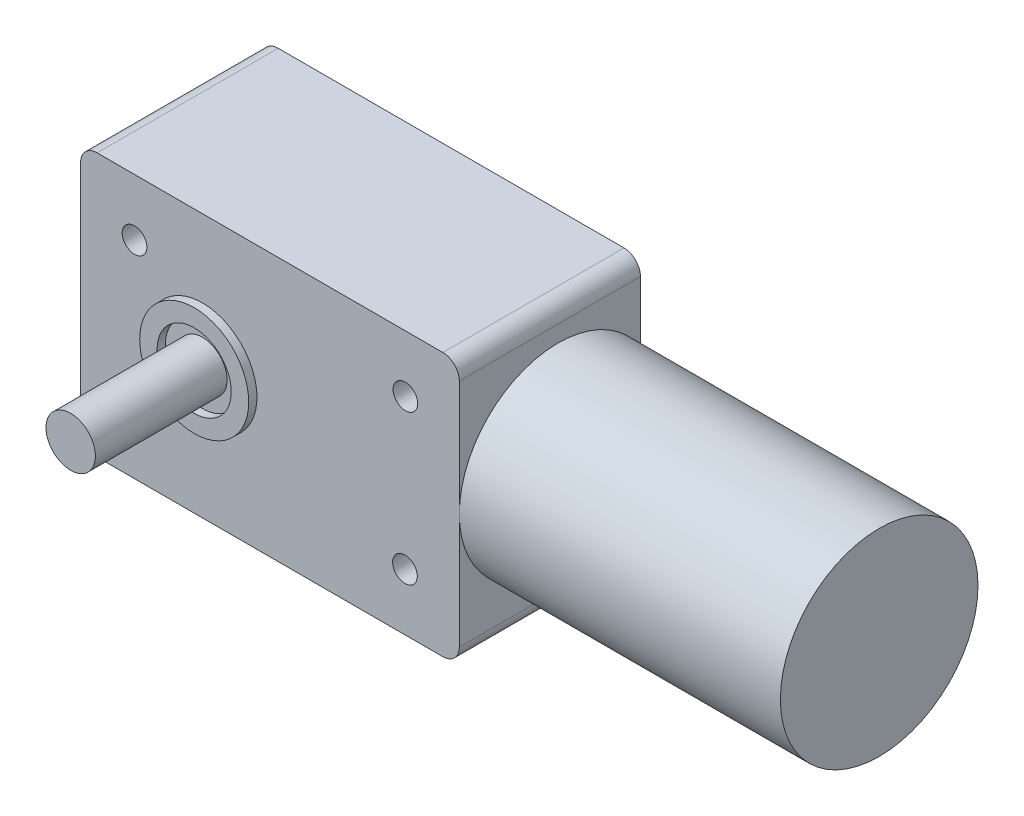
ISO-10303-21;
HEADER;
FILE_DESCRIPTION(('STEP AP214'),'2;1');
FILE_NAME('part.step','',(''),(''),'','','');
FILE_SCHEMA(('AUTOMOTIVE_DESIGN { 1 0 10303 214 1 1 1 1 }'));
ENDSEC;
DATA;
#1=APPLICATION_CONTEXT('core data for automotive mechanical design processes');
#2=APPLICATION_PROTOCOL_DEFINITION('international standard','automotive_design',2000,#1);
#3=PRODUCT_CONTEXT('',#1,'mechanical');
#4=PRODUCT('Part','Part','',(#3));
#5=PRODUCT_RELATED_PRODUCT_CATEGORY('part','',(#4));
#6=PRODUCT_DEFINITION_FORMATION('','',#4);
#7=PRODUCT_DEFINITION_CONTEXT('part definition',#1,'design');
#8=PRODUCT_DEFINITION('design','',#6,#7);
#9=PRODUCT_DEFINITION_SHAPE('','',#8);
#10=(LENGTH_UNIT() NAMED_UNIT(*) SI_UNIT(.MILLI.,.METRE.));
#11=(NAMED_UNIT(*) PLANE_ANGLE_UNIT() SI_UNIT($,.RADIAN.));
#12=(NAMED_UNIT(*) SI_UNIT($,.STERADIAN.) SOLID_ANGLE_UNIT());
#13=UNCERTAINTY_MEASURE_WITH_UNIT(LENGTH_MEASURE(1.E-05),#10,'distance_accuracy_value','');
#14=(GEOMETRIC_REPRESENTATION_CONTEXT(3) GLOBAL_UNCERTAINTY_ASSIGNED_CONTEXT((#13)) GLOBAL_UNIT_ASSIGNED_CONTEXT((#10,
#11,#12)) REPRESENTATION_CONTEXT('',''));
#15=CARTESIAN_POINT('',(0.,0.,0.));
#16=DIRECTION('',(0.,0.,1.));
#17=DIRECTION('',(1.,0.,0.));
#18=AXIS2_PLACEMENT_3D('',#15,#16,#17);
#19=CARTESIAN_POINT('',(23.,-14.,22.));
#20=DIRECTION('',(-1.,0.,0.));
#21=DIRECTION('',(0.,0.,1.));
#22=AXIS2_PLACEMENT_3D('',#19,#20,#21);
#23=PLANE('',#22);
#24=CARTESIAN_POINT('',(23.,0.,10.));
#25=DIRECTION('',(1.,0.,0.));
#26=DIRECTION('',(0.,0.,-1.));
#27=AXIS2_PLACEMENT_3D('',#24,#25,#26);
#28=CIRCLE('',#27,12.);
#29=CARTESIAN_POINT('',(23.,0.,22.));
#30=VERTEX_POINT('',#29);
#31=CARTESIAN_POINT('',(23.,-6.63324958071081,0.));
#32=VERTEX_POINT('',#31);
#33=EDGE_CURVE('E50',#30,#32,#28,.T.);
#34=ORIENTED_EDGE('',*,*,#33,.F.);
#35=DIRECTION('',(0.,1.,0.));
#36=VECTOR('',#35,1.);
#37=CARTESIAN_POINT('',(23.,-14.,22.));
#38=LINE('',#37,#36);
#39=CARTESIAN_POINT('',(23.,-14.,22.));
#40=VERTEX_POINT('',#39);
#41=EDGE_CURVE('E182',#40,#30,#38,.T.);
#42=ORIENTED_EDGE('',*,*,#41,.F.);
#43=DIRECTION('',(0.,0.,-1.));
#44=VECTOR('',#43,1.);
#45=CARTESIAN_POINT('',(23.,-14.,22.));
#46=LINE('',#45,#44);
#47=CARTESIAN_POINT('',(23.,-14.,0.));
#48=VERTEX_POINT('',#47);
#49=EDGE_CURVE('E217',#40,#48,#46,.T.);
#50=ORIENTED_EDGE('',*,*,#49,.T.);
#51=DIRECTION('',(0.,1.,0.));
#52=VECTOR('',#51,1.);
#53=CARTESIAN_POINT('',(23.,-14.,0.));
#54=LINE('',#53,#52);
#55=EDGE_CURVE('E120',#48,#32,#54,.T.);
#56=ORIENTED_EDGE('',*,*,#55,.T.);
#57=EDGE_LOOP('',(#34,#42,#50,#56));
#58=FACE_BOUND('',#57,.T.);
#59=ADVANCED_FACE('F35',(#58),#23,.F.);
#60=CARTESIAN_POINT('',(-21.,-14.,22.));
#61=DIRECTION('',(0.,0.,-1.));
#62=DIRECTION('',(-1.,0.,0.));
#63=AXIS2_PLACEMENT_3D('',#60,#61,#62);
#64=CYLINDRICAL_SURFACE('',#63,2.);
#65=CARTESIAN_POINT('',(-21.,-14.,0.));
#66=DIRECTION('',(0.,0.,1.));
#67=DIRECTION('',(-1.,0.,0.));
#68=AXIS2_PLACEMENT_3D('',#65,#66,#67);
#69=CIRCLE('',#68,2.);
#70=CARTESIAN_POINT('',(-23.,-14.,0.));
#71=VERTEX_POINT('',#70);
#72=CARTESIAN_POINT('',(-21.,-16.,0.));
#73=VERTEX_POINT('',#72);
#74=EDGE_CURVE('E171',#71,#73,#69,.T.);
#75=ORIENTED_EDGE('',*,*,#74,.T.);
#76=DIRECTION('',(0.,0.,-1.));
#77=VECTOR('',#76,1.);
#78=CARTESIAN_POINT('',(-21.,-16.,22.));
#79=LINE('',#78,#77);
#80=CARTESIAN_POINT('',(-21.,-16.,22.));
#81=VERTEX_POINT('',#80);
#82=EDGE_CURVE('E223',#81,#73,#79,.T.);
#83=ORIENTED_EDGE('',*,*,#82,.F.);
#84=CARTESIAN_POINT('',(-21.,-14.,22.));
#85=DIRECTION('',(0.,0.,1.));
#86=DIRECTION('',(-1.,0.,0.));
#87=AXIS2_PLACEMENT_3D('',#84,#85,#86);
#88=CIRCLE('',#87,2.);
#89=CARTESIAN_POINT('',(-23.,-14.,22.));
#90=VERTEX_POINT('',#89);
#91=EDGE_CURVE('E174',#90,#81,#88,.T.);
#92=ORIENTED_EDGE('',*,*,#91,.F.);
#93=DIRECTION('',(0.,0.,-1.));
#94=VECTOR('',#93,1.);
#95=CARTESIAN_POINT('',(-23.,-14.,22.));
#96=LINE('',#95,#94);
#97=EDGE_CURVE('E192',#90,#71,#96,.T.);
#98=ORIENTED_EDGE('',*,*,#97,.T.);
#99=EDGE_LOOP('',(#75,#83,#92,#98));
#100=FACE_BOUND('',#99,.T.);
#101=ADVANCED_FACE('F37',(#100),#64,.T.);
#102=CARTESIAN_POINT('',(-21.,-16.,22.));
#103=DIRECTION('',(0.,1.,0.));
#104=DIRECTION('',(0.,0.,1.));
#105=AXIS2_PLACEMENT_3D('',#102,#103,#104);
#106=PLANE('',#105);
#107=DIRECTION('',(1.,0.,0.));
#108=VECTOR('',#107,1.);
#109=CARTESIAN_POINT('',(-21.,-16.,0.));
#110=LINE('',#109,#108);
#111=CARTESIAN_POINT('',(21.,-16.,0.));
#112=VERTEX_POINT('',#111);
#113=EDGE_CURVE('E195',#73,#112,#110,.T.);
#114=ORIENTED_EDGE('',*,*,#113,.T.);
#115=DIRECTION('',(0.,0.,-1.));
#116=VECTOR('',#115,1.);
#117=CARTESIAN_POINT('',(21.,-16.,22.));
#118=LINE('',#117,#116);
#119=CARTESIAN_POINT('',(21.,-16.,22.));
#120=VERTEX_POINT('',#119);
#121=EDGE_CURVE('E220',#120,#112,#118,.T.);
#122=ORIENTED_EDGE('',*,*,#121,.F.);
#123=DIRECTION('',(1.,0.,0.));
#124=VECTOR('',#123,1.);
#125=CARTESIAN_POINT('',(-21.,-16.,22.));
#126=LINE('',#125,#124);
#127=EDGE_CURVE('E177',#81,#120,#126,.T.);
#128=ORIENTED_EDGE('',*,*,#127,.F.);
#129=ORIENTED_EDGE('',*,*,#82,.T.);
#130=EDGE_LOOP('',(#114,#122,#128,#129));
#131=FACE_BOUND('',#130,.T.);
#132=ADVANCED_FACE('F251',(#131),#106,.F.);
#133=CARTESIAN_POINT('',(21.,-14.,22.));
#134=DIRECTION('',(0.,0.,-1.));
#135=DIRECTION('',(-1.,0.,0.));
#136=AXIS2_PLACEMENT_3D('',#133,#134,#135);
#137=CYLINDRICAL_SURFACE('',#136,2.);
#138=CARTESIAN_POINT('',(21.,-14.,0.));
#139=DIRECTION('',(0.,0.,1.));
#140=DIRECTION('',(1.,0.,0.));
#141=AXIS2_PLACEMENT_3D('',#138,#139,#140);
#142=CIRCLE('',#141,2.);
#143=EDGE_CURVE('E118',#112,#48,#142,.T.);
#144=ORIENTED_EDGE('',*,*,#143,.T.);
#145=ORIENTED_EDGE('',*,*,#49,.F.);
#146=CARTESIAN_POINT('',(21.,-14.,22.));
#147=DIRECTION('',(0.,0.,1.));
#148=DIRECTION('',(1.,0.,0.));
#149=AXIS2_PLACEMENT_3D('',#146,#147,#148);
#150=CIRCLE('',#149,2.);
#151=EDGE_CURVE('E180',#120,#40,#150,.T.);
#152=ORIENTED_EDGE('',*,*,#151,.F.);
#153=ORIENTED_EDGE('',*,*,#121,.T.);
#154=EDGE_LOOP('',(#144,#145,#152,#153));
#155=FACE_BOUND('',#154,.T.);
#156=ADVANCED_FACE('F256',(#155),#137,.T.);
#157=CARTESIAN_POINT('',(23.,6.63324958071081,0.));
#158=VERTEX_POINT('',#157);
#159=EDGE_CURVE('E122',#158,#30,#28,.T.);
#160=ORIENTED_EDGE('',*,*,#159,.F.);
#161=CARTESIAN_POINT('',(23.,14.,0.));
#162=VERTEX_POINT('',#161);
#163=EDGE_CURVE('E109',#158,#162,#54,.T.);
#164=ORIENTED_EDGE('',*,*,#163,.T.);
#165=DIRECTION('',(0.,0.,-1.));
#166=VECTOR('',#165,1.);
#167=CARTESIAN_POINT('',(23.,14.,22.));
#168=LINE('',#167,#166);
#169=CARTESIAN_POINT('',(23.,14.,22.));
#170=VERTEX_POINT('',#169);
#171=EDGE_CURVE('E215',#170,#162,#168,.T.);
#172=ORIENTED_EDGE('',*,*,#171,.F.);
#173=EDGE_CURVE('E124',#30,#170,#38,.T.);
#174=ORIENTED_EDGE('',*,*,#173,.F.);
#175=EDGE_LOOP('',(#160,#164,#172,#174));
#176=FACE_BOUND('',#175,.T.);
#177=ADVANCED_FACE('F123',(#176),#23,.F.);
#178=CARTESIAN_POINT('',(21.,14.,22.));
#179=DIRECTION('',(0.,0.,-1.));
#180=DIRECTION('',(-1.,0.,0.));
#181=AXIS2_PLACEMENT_3D('',#178,#179,#180);
#182=CYLINDRICAL_SURFACE('',#181,2.);
#183=CARTESIAN_POINT('',(21.,14.,0.));
#184=DIRECTION('',(0.,0.,1.));
#185=DIRECTION('',(-1.,0.,0.));
#186=AXIS2_PLACEMENT_3D('',#183,#184,#185);
#187=CIRCLE('',#186,2.);
#188=CARTESIAN_POINT('',(21.,16.,0.));
#189=VERTEX_POINT('',#188);
#190=EDGE_CURVE('E114',#162,#189,#187,.T.);
#191=ORIENTED_EDGE('',*,*,#190,.T.);
#192=DIRECTION('',(0.,0.,-1.));
#193=VECTOR('',#192,1.);
#194=CARTESIAN_POINT('',(21.,16.,22.));
#195=LINE('',#194,#193);
#196=CARTESIAN_POINT('',(21.,16.,22.));
#197=VERTEX_POINT('',#196);
#198=EDGE_CURVE('E212',#197,#189,#195,.T.);
#199=ORIENTED_EDGE('',*,*,#198,.F.);
#200=CARTESIAN_POINT('',(21.,14.,22.));
#201=DIRECTION('',(0.,0.,1.));
#202=DIRECTION('',(-1.,0.,0.));
#203=AXIS2_PLACEMENT_3D('',#200,#201,#202);
#204=CIRCLE('',#203,2.);
#205=EDGE_CURVE('E184',#170,#197,#204,.T.);
#206=ORIENTED_EDGE('',*,*,#205,.F.);
#207=ORIENTED_EDGE('',*,*,#171,.T.);
#208=EDGE_LOOP('',(#191,#199,#206,#207));
#209=FACE_BOUND('',#208,.T.);
#210=ADVANCED_FACE('F271',(#209),#182,.T.);
#211=CARTESIAN_POINT('',(-21.,16.,22.));
#212=DIRECTION('',(0.,-1.,0.));
#213=DIRECTION('',(0.,0.,-1.));
#214=AXIS2_PLACEMENT_3D('',#211,#212,#213);
#215=PLANE('',#214);
#216=DIRECTION('',(-1.,0.,0.));
#217=VECTOR('',#216,1.);
#218=CARTESIAN_POINT('',(-21.,16.,0.));
#219=LINE('',#218,#217);
#220=CARTESIAN_POINT('',(-21.,16.,0.));
#221=VERTEX_POINT('',#220);
#222=EDGE_CURVE('E199',#189,#221,#219,.T.);
#223=ORIENTED_EDGE('',*,*,#222,.T.);
#224=DIRECTION('',(0.,0.,-1.));
#225=VECTOR('',#224,1.);
#226=CARTESIAN_POINT('',(-21.,16.,22.));
#227=LINE('',#226,#225);
#228=CARTESIAN_POINT('',(-21.,16.,22.));
#229=VERTEX_POINT('',#228);
#230=EDGE_CURVE('E209',#229,#221,#227,.T.);
#231=ORIENTED_EDGE('',*,*,#230,.F.);
#232=DIRECTION('',(-1.,0.,0.));
#233=VECTOR('',#232,1.);
#234=CARTESIAN_POINT('',(-21.,16.,22.));
#235=LINE('',#234,#233);
#236=EDGE_CURVE('E186',#197,#229,#235,.T.);
#237=ORIENTED_EDGE('',*,*,#236,.F.);
#238=ORIENTED_EDGE('',*,*,#198,.T.);
#239=EDGE_LOOP('',(#223,#231,#237,#238));
#240=FACE_BOUND('',#239,.T.);
#241=ADVANCED_FACE('F267',(#240),#215,.F.);
#242=CARTESIAN_POINT('',(-21.,14.,22.));
#243=DIRECTION('',(0.,0.,-1.));
#244=DIRECTION('',(-1.,0.,0.));
#245=AXIS2_PLACEMENT_3D('',#242,#243,#244);
#246=CYLINDRICAL_SURFACE('',#245,2.);
#247=CARTESIAN_POINT('',(-21.,14.,0.));
#248=DIRECTION('',(0.,0.,1.));
#249=DIRECTION('',(-1.,0.,0.));
#250=AXIS2_PLACEMENT_3D('',#247,#248,#249);
#251=CIRCLE('',#250,2.);
#252=CARTESIAN_POINT('',(-23.,14.,0.));
#253=VERTEX_POINT('',#252);
#254=EDGE_CURVE('E201',#221,#253,#251,.T.);
#255=ORIENTED_EDGE('',*,*,#254,.T.);
#256=DIRECTION('',(0.,0.,-1.));
#257=VECTOR('',#256,1.);
#258=CARTESIAN_POINT('',(-23.,14.,22.));
#259=LINE('',#258,#257);
#260=CARTESIAN_POINT('',(-23.,14.,22.));
#261=VERTEX_POINT('',#260);
#262=EDGE_CURVE('E206',#261,#253,#259,.T.);
#263=ORIENTED_EDGE('',*,*,#262,.F.);
#264=CARTESIAN_POINT('',(-21.,14.,22.));
#265=DIRECTION('',(0.,0.,1.));
#266=DIRECTION('',(-1.,0.,0.));
#267=AXIS2_PLACEMENT_3D('',#264,#265,#266);
#268=CIRCLE('',#267,2.);
#269=EDGE_CURVE('E188',#229,#261,#268,.T.);
#270=ORIENTED_EDGE('',*,*,#269,.F.);
#271=ORIENTED_EDGE('',*,*,#230,.T.);
#272=EDGE_LOOP('',(#255,#263,#270,#271));
#273=FACE_BOUND('',#272,.T.);
#274=ADVANCED_FACE('F263',(#273),#246,.T.);
#275=CARTESIAN_POINT('',(-23.,-14.,22.));
#276=DIRECTION('',(1.,0.,0.));
#277=DIRECTION('',(0.,0.,-1.));
#278=AXIS2_PLACEMENT_3D('',#275,#276,#277);
#279=PLANE('',#278);
#280=DIRECTION('',(0.,-1.,0.));
#281=VECTOR('',#280,1.);
#282=CARTESIAN_POINT('',(-23.,-14.,0.));
#283=LINE('',#282,#281);
#284=EDGE_CURVE('E178',#253,#71,#283,.T.);
#285=ORIENTED_EDGE('',*,*,#284,.T.);
#286=ORIENTED_EDGE('',*,*,#97,.F.);
#287=DIRECTION('',(0.,-1.,0.));
#288=VECTOR('',#287,1.);
#289=CARTESIAN_POINT('',(-23.,-14.,22.));
#290=LINE('',#289,#288);
#291=EDGE_CURVE('E190',#261,#90,#290,.T.);
#292=ORIENTED_EDGE('',*,*,#291,.F.);
#293=ORIENTED_EDGE('',*,*,#262,.T.);
#294=EDGE_LOOP('',(#285,#286,#292,#293));
#295=FACE_BOUND('',#294,.T.);
#296=ADVANCED_FACE('F233',(#295),#279,.F.);
#297=CARTESIAN_POINT('',(-21.,-14.,22.));
#298=DIRECTION('',(0.,0.,-1.));
#299=DIRECTION('',(-1.,0.,0.));
#300=AXIS2_PLACEMENT_3D('',#297,#298,#299);
#301=PLANE('',#300);
#302=CARTESIAN_POINT('',(-8.19999999999999,0.,22.));
#303=DIRECTION('',(0.,0.,-1.));
#304=DIRECTION('',(-1.,0.,0.));
#305=AXIS2_PLACEMENT_3D('',#302,#303,#304);
#306=CIRCLE('',#305,6.62);
#307=CARTESIAN_POINT('',(-14.82,0.,22.));
#308=VERTEX_POINT('',#307);
#309=EDGE_CURVE('E43',#308,#308,#306,.F.);
#310=ORIENTED_EDGE('',*,*,#309,.F.);
#311=EDGE_LOOP('',(#310));
#312=FACE_BOUND('',#311,.T.);
#313=CARTESIAN_POINT('',(-16.4999999999998,-9.09993131855173,22.));
#314=DIRECTION('',(0.,0.,1.));
#315=DIRECTION('',(1.,0.,0.));
#316=AXIS2_PLACEMENT_3D('',#313,#314,#315);
#317=CIRCLE('',#316,1.49999999999999);
#318=CARTESIAN_POINT('',(-14.9999999999998,-9.09993131855173,22.));
#319=VERTEX_POINT('',#318);
#320=EDGE_CURVE('E147',#319,#319,#317,.T.);
#321=ORIENTED_EDGE('',*,*,#320,.F.);
#322=EDGE_LOOP('',(#321));
#323=FACE_BOUND('',#322,.T.);
#324=CARTESIAN_POINT('',(16.4000000000002,-9.09993131855172,22.));
#325=DIRECTION('',(0.,0.,1.));
#326=DIRECTION('',(1.,0.,0.));
#327=AXIS2_PLACEMENT_3D('',#324,#325,#326);
#328=CIRCLE('',#327,1.5);
#329=CARTESIAN_POINT('',(17.9000000000002,-9.09993131855172,22.));
#330=VERTEX_POINT('',#329);
#331=EDGE_CURVE('E160',#330,#330,#328,.T.);
#332=ORIENTED_EDGE('',*,*,#331,.F.);
#333=EDGE_LOOP('',(#332));
#334=FACE_BOUND('',#333,.T.);
#335=CARTESIAN_POINT('',(16.45,9.1,22.));
#336=DIRECTION('',(0.,0.,1.));
#337=DIRECTION('',(1.,0.,0.));
#338=AXIS2_PLACEMENT_3D('',#335,#336,#337);
#339=CIRCLE('',#338,1.5);
#340=CARTESIAN_POINT('',(17.95,9.1,22.));
#341=VERTEX_POINT('',#340);
#342=EDGE_CURVE('E154',#341,#341,#339,.T.);
#343=ORIENTED_EDGE('',*,*,#342,.F.);
#344=EDGE_LOOP('',(#343));
#345=FACE_BOUND('',#344,.T.);
#346=CARTESIAN_POINT('',(-16.45,9.1,22.));
#347=DIRECTION('',(0.,0.,1.));
#348=DIRECTION('',(1.,0.,0.));
#349=AXIS2_PLACEMENT_3D('',#346,#347,#348);
#350=CIRCLE('',#349,1.5);
#351=CARTESIAN_POINT('',(-14.95,9.1,22.));
#352=VERTEX_POINT('',#351);
#353=EDGE_CURVE('E153',#352,#352,#350,.T.);
#354=ORIENTED_EDGE('',*,*,#353,.F.);
#355=EDGE_LOOP('',(#354));
#356=FACE_BOUND('',#355,.T.);
#357=ORIENTED_EDGE('',*,*,#91,.T.);
#358=ORIENTED_EDGE('',*,*,#127,.T.);
#359=ORIENTED_EDGE('',*,*,#151,.T.);
#360=ORIENTED_EDGE('',*,*,#41,.T.);
#361=ORIENTED_EDGE('',*,*,#173,.T.);
#362=ORIENTED_EDGE('',*,*,#205,.T.);
#363=ORIENTED_EDGE('',*,*,#236,.T.);
#364=ORIENTED_EDGE('',*,*,#269,.T.);
#365=ORIENTED_EDGE('',*,*,#291,.T.);
#366=EDGE_LOOP('',(#357,#358,#359,#360,#361,#362,#363,#364,#365));
#367=FACE_BOUND('',#366,.T.);
#368=ADVANCED_FACE('F230',(#312,#323,#334,#345,#356,#367),#301,.F.);
#369=CARTESIAN_POINT('',(-21.,-14.,0.));
#370=DIRECTION('',(0.,0.,-1.));
#371=DIRECTION('',(-1.,0.,0.));
#372=AXIS2_PLACEMENT_3D('',#369,#370,#371);
#373=PLANE('',#372);
#374=ORIENTED_EDGE('',*,*,#74,.F.);
#375=ORIENTED_EDGE('',*,*,#284,.F.);
#376=ORIENTED_EDGE('',*,*,#254,.F.);
#377=ORIENTED_EDGE('',*,*,#222,.F.);
#378=ORIENTED_EDGE('',*,*,#190,.F.);
#379=ORIENTED_EDGE('',*,*,#163,.F.);
#380=EDGE_CURVE('E58',#32,#158,#54,.T.);
#381=ORIENTED_EDGE('',*,*,#380,.F.);
#382=ORIENTED_EDGE('',*,*,#55,.F.);
#383=ORIENTED_EDGE('',*,*,#143,.F.);
#384=ORIENTED_EDGE('',*,*,#113,.F.);
#385=EDGE_LOOP('',(#374,#375,#376,#377,#378,#379,#381,#382,#383,#384));
#386=FACE_BOUND('',#385,.T.);
#387=ADVANCED_FACE('F112',(#386),#373,.T.);
#388=CARTESIAN_POINT('',(-16.45,9.1,19.));
#389=DIRECTION('',(0.,0.,1.));
#390=DIRECTION('',(1.,0.,0.));
#391=AXIS2_PLACEMENT_3D('',#388,#389,#390);
#392=CYLINDRICAL_SURFACE('',#391,1.5);
#393=CARTESIAN_POINT('',(-16.45,9.1,19.));
#394=DIRECTION('',(0.,0.,1.));
#395=DIRECTION('',(1.,0.,0.));
#396=AXIS2_PLACEMENT_3D('',#393,#394,#395);
#397=CIRCLE('',#396,1.5);
#398=CARTESIAN_POINT('',(-14.95,9.1,19.));
#399=VERTEX_POINT('',#398);
#400=EDGE_CURVE('E168',#399,#399,#397,.T.);
#401=ORIENTED_EDGE('',*,*,#400,.F.);
#402=EDGE_LOOP('',(#401));
#403=FACE_BOUND('',#402,.T.);
#404=ORIENTED_EDGE('',*,*,#353,.T.);
#405=EDGE_LOOP('',(#404));
#406=FACE_BOUND('',#405,.T.);
#407=ADVANCED_FACE('F320',(#403,#406),#392,.F.);
#408=CARTESIAN_POINT('',(-16.45,9.1,19.));
#409=DIRECTION('',(0.,0.,1.));
#410=DIRECTION('',(1.,0.,0.));
#411=AXIS2_PLACEMENT_3D('',#408,#409,#410);
#412=PLANE('',#411);
#413=ORIENTED_EDGE('',*,*,#400,.T.);
#414=EDGE_LOOP('',(#413));
#415=FACE_BOUND('',#414,.T.);
#416=ADVANCED_FACE('F382',(#415),#412,.T.);
#417=CARTESIAN_POINT('',(16.45,9.1,19.));
#418=DIRECTION('',(0.,0.,1.));
#419=DIRECTION('',(1.,0.,0.));
#420=AXIS2_PLACEMENT_3D('',#417,#418,#419);
#421=CYLINDRICAL_SURFACE('',#420,1.5);
#422=CARTESIAN_POINT('',(16.45,9.1,19.));
#423=DIRECTION('',(0.,0.,1.));
#424=DIRECTION('',(1.,0.,0.));
#425=AXIS2_PLACEMENT_3D('',#422,#423,#424);
#426=CIRCLE('',#425,1.5);
#427=CARTESIAN_POINT('',(17.95,9.1,19.));
#428=VERTEX_POINT('',#427);
#429=EDGE_CURVE('E150',#428,#428,#426,.T.);
#430=ORIENTED_EDGE('',*,*,#429,.F.);
#431=EDGE_LOOP('',(#430));
#432=FACE_BOUND('',#431,.T.);
#433=ORIENTED_EDGE('',*,*,#342,.T.);
#434=EDGE_LOOP('',(#433));
#435=FACE_BOUND('',#434,.T.);
#436=ADVANCED_FACE('F378',(#432,#435),#421,.F.);
#437=CARTESIAN_POINT('',(16.45,9.1,19.));
#438=DIRECTION('',(0.,0.,1.));
#439=DIRECTION('',(1.,0.,0.));
#440=AXIS2_PLACEMENT_3D('',#437,#438,#439);
#441=PLANE('',#440);
#442=ORIENTED_EDGE('',*,*,#429,.T.);
#443=EDGE_LOOP('',(#442));
#444=FACE_BOUND('',#443,.T.);
#445=ADVANCED_FACE('F374',(#444),#441,.T.);
#446=CARTESIAN_POINT('',(16.4000000000002,-9.09993131855172,19.));
#447=DIRECTION('',(0.,0.,1.));
#448=DIRECTION('',(1.,0.,0.));
#449=AXIS2_PLACEMENT_3D('',#446,#447,#448);
#450=CYLINDRICAL_SURFACE('',#449,1.5);
#451=CARTESIAN_POINT('',(16.4000000000002,-9.09993131855172,19.));
#452=DIRECTION('',(0.,0.,1.));
#453=DIRECTION('',(1.,0.,0.));
#454=AXIS2_PLACEMENT_3D('',#451,#452,#453);
#455=CIRCLE('',#454,1.5);
#456=CARTESIAN_POINT('',(17.9000000000002,-9.09993131855172,19.));
#457=VERTEX_POINT('',#456);
#458=EDGE_CURVE('E157',#457,#457,#455,.T.);
#459=ORIENTED_EDGE('',*,*,#458,.F.);
#460=EDGE_LOOP('',(#459));
#461=FACE_BOUND('',#460,.T.);
#462=ORIENTED_EDGE('',*,*,#331,.T.);
#463=EDGE_LOOP('',(#462));
#464=FACE_BOUND('',#463,.T.);
#465=ADVANCED_FACE('F377',(#461,#464),#450,.F.);
#466=CARTESIAN_POINT('',(16.4000000000002,-9.09993131855172,19.));
#467=DIRECTION('',(0.,0.,1.));
#468=DIRECTION('',(1.,0.,0.));
#469=AXIS2_PLACEMENT_3D('',#466,#467,#468);
#470=PLANE('',#469);
#471=ORIENTED_EDGE('',*,*,#458,.T.);
#472=EDGE_LOOP('',(#471));
#473=FACE_BOUND('',#472,.T.);
#474=ADVANCED_FACE('F384',(#473),#470,.T.);
#475=CARTESIAN_POINT('',(-16.4999999999998,-9.09993131855173,19.));
#476=DIRECTION('',(0.,0.,1.));
#477=DIRECTION('',(1.,0.,0.));
#478=AXIS2_PLACEMENT_3D('',#475,#476,#477);
#479=CYLINDRICAL_SURFACE('',#478,1.49999999999999);
#480=CARTESIAN_POINT('',(-16.4999999999998,-9.09993131855173,19.));
#481=DIRECTION('',(0.,0.,1.));
#482=DIRECTION('',(1.,0.,0.));
#483=AXIS2_PLACEMENT_3D('',#480,#481,#482);
#484=CIRCLE('',#483,1.49999999999999);
#485=CARTESIAN_POINT('',(-14.9999999999998,-9.09993131855173,19.));
#486=VERTEX_POINT('',#485);
#487=EDGE_CURVE('E163',#486,#486,#484,.T.);
#488=ORIENTED_EDGE('',*,*,#487,.F.);
#489=EDGE_LOOP('',(#488));
#490=FACE_BOUND('',#489,.T.);
#491=ORIENTED_EDGE('',*,*,#320,.T.);
#492=EDGE_LOOP('',(#491));
#493=FACE_BOUND('',#492,.T.);
#494=ADVANCED_FACE('F387',(#490,#493),#479,.F.);
#495=CARTESIAN_POINT('',(-16.4999999999998,-9.09993131855173,19.));
#496=DIRECTION('',(0.,0.,1.));
#497=DIRECTION('',(1.,0.,0.));
#498=AXIS2_PLACEMENT_3D('',#495,#496,#497);
#499=PLANE('',#498);
#500=ORIENTED_EDGE('',*,*,#487,.T.);
#501=EDGE_LOOP('',(#500));
#502=FACE_BOUND('',#501,.T.);
#503=ADVANCED_FACE('F372',(#502),#499,.T.);
#504=CARTESIAN_POINT('',(-8.19999999999999,0.,23.));
#505=DIRECTION('',(0.,0.,-1.));
#506=DIRECTION('',(-1.,0.,0.));
#507=AXIS2_PLACEMENT_3D('',#504,#505,#506);
#508=CYLINDRICAL_SURFACE('',#507,4.5);
#509=CARTESIAN_POINT('',(-8.19999999999999,0.,23.));
#510=DIRECTION('',(0.,0.,1.));
#511=DIRECTION('',(1.,0.,0.));
#512=AXIS2_PLACEMENT_3D('',#509,#510,#511);
#513=CIRCLE('',#512,4.5);
#514=CARTESIAN_POINT('',(-3.69999999999999,0.,23.));
#515=VERTEX_POINT('',#514);
#516=EDGE_CURVE('E141',#515,#515,#513,.T.);
#517=ORIENTED_EDGE('',*,*,#516,.T.);
#518=EDGE_LOOP('',(#517));
#519=FACE_BOUND('',#518,.T.);
#520=CARTESIAN_POINT('',(-8.19999999999999,0.,22.));
#521=DIRECTION('',(0.,0.,1.));
#522=DIRECTION('',(1.,0.,0.));
#523=AXIS2_PLACEMENT_3D('',#520,#521,#522);
#524=CIRCLE('',#523,4.5);
#525=CARTESIAN_POINT('',(-3.69999999999999,0.,22.));
#526=VERTEX_POINT('',#525);
#527=EDGE_CURVE('E140',#526,#526,#524,.T.);
#528=ORIENTED_EDGE('',*,*,#527,.F.);
#529=EDGE_LOOP('',(#528));
#530=FACE_BOUND('',#529,.T.);
#531=ADVANCED_FACE('F368',(#519,#530),#508,.F.);
#532=CARTESIAN_POINT('',(-8.19999999999999,0.,23.));
#533=DIRECTION('',(0.,0.,-1.));
#534=DIRECTION('',(-1.,0.,0.));
#535=AXIS2_PLACEMENT_3D('',#532,#533,#534);
#536=CYLINDRICAL_SURFACE('',#535,6.62);
#537=CARTESIAN_POINT('',(-8.19999999999999,0.,23.));
#538=DIRECTION('',(0.,0.,1.));
#539=DIRECTION('',(1.,0.,0.));
#540=AXIS2_PLACEMENT_3D('',#537,#538,#539);
#541=CIRCLE('',#540,6.62);
#542=CARTESIAN_POINT('',(-1.57999999999999,0.,23.));
#543=VERTEX_POINT('',#542);
#544=EDGE_CURVE('E144',#543,#543,#541,.T.);
#545=ORIENTED_EDGE('',*,*,#544,.F.);
#546=EDGE_LOOP('',(#545));
#547=FACE_BOUND('',#546,.T.);
#548=ORIENTED_EDGE('',*,*,#309,.T.);
#549=EDGE_LOOP('',(#548));
#550=FACE_BOUND('',#549,.T.);
#551=ADVANCED_FACE('F228',(#547,#550),#536,.T.);
#552=CARTESIAN_POINT('',(0.,0.,23.));
#553=DIRECTION('',(0.,0.,1.));
#554=DIRECTION('',(1.,0.,0.));
#555=AXIS2_PLACEMENT_3D('',#552,#553,#554);
#556=PLANE('',#555);
#557=ORIENTED_EDGE('',*,*,#516,.F.);
#558=EDGE_LOOP('',(#557));
#559=FACE_BOUND('',#558,.T.);
#560=ORIENTED_EDGE('',*,*,#544,.T.);
#561=EDGE_LOOP('',(#560));
#562=FACE_BOUND('',#561,.T.);
#563=ADVANCED_FACE('F362',(#559,#562),#556,.T.);
#564=CARTESIAN_POINT('',(-8.19999999999999,0.,22.));
#565=DIRECTION('',(0.,0.,-1.));
#566=DIRECTION('',(-1.,0.,0.));
#567=AXIS2_PLACEMENT_3D('',#564,#565,#566);
#568=CIRCLE('',#567,3.);
#569=CARTESIAN_POINT('',(-11.2,0.,22.));
#570=VERTEX_POINT('',#569);
#571=EDGE_CURVE('E11',#570,#570,#568,.F.);
#572=ORIENTED_EDGE('',*,*,#571,.F.);
#573=EDGE_LOOP('',(#572));
#574=FACE_BOUND('',#573,.T.);
#575=ORIENTED_EDGE('',*,*,#527,.T.);
#576=EDGE_LOOP('',(#575));
#577=FACE_BOUND('',#576,.T.);
#578=ADVANCED_FACE('F235',(#574,#577),#301,.F.);
#579=CARTESIAN_POINT('',(-8.19999999999999,0.,38.));
#580=DIRECTION('',(0.,0.,-1.));
#581=DIRECTION('',(-1.,0.,0.));
#582=AXIS2_PLACEMENT_3D('',#579,#580,#581);
#583=CYLINDRICAL_SURFACE('',#582,3.);
#584=CARTESIAN_POINT('',(-8.19999999999999,0.,38.));
#585=DIRECTION('',(0.,0.,1.));
#586=DIRECTION('',(1.,0.,0.));
#587=AXIS2_PLACEMENT_3D('',#584,#585,#586);
#588=CIRCLE('',#587,3.);
#589=CARTESIAN_POINT('',(-5.19999999999999,0.,38.));
#590=VERTEX_POINT('',#589);
#591=EDGE_CURVE('E137',#590,#590,#588,.T.);
#592=ORIENTED_EDGE('',*,*,#591,.F.);
#593=EDGE_LOOP('',(#592));
#594=FACE_BOUND('',#593,.T.);
#595=ORIENTED_EDGE('',*,*,#571,.T.);
#596=EDGE_LOOP('',(#595));
#597=FACE_BOUND('',#596,.T.);
#598=ADVANCED_FACE('F357',(#594,#597),#583,.T.);
#599=CARTESIAN_POINT('',(-8.19999999999999,0.,38.));
#600=DIRECTION('',(0.,0.,1.));
#601=DIRECTION('',(1.,0.,0.));
#602=AXIS2_PLACEMENT_3D('',#599,#600,#601);
#603=PLANE('',#602);
#604=ORIENTED_EDGE('',*,*,#591,.T.);
#605=EDGE_LOOP('',(#604));
#606=FACE_BOUND('',#605,.T.);
#607=ADVANCED_FACE('F332',(#606),#603,.T.);
#608=CARTESIAN_POINT('',(62.,0.,10.));
#609=DIRECTION('',(-1.,0.,0.));
#610=DIRECTION('',(0.,0.,1.));
#611=AXIS2_PLACEMENT_3D('',#608,#609,#610);
#612=CYLINDRICAL_SURFACE('',#611,12.);
#613=CARTESIAN_POINT('',(62.,0.,10.));
#614=DIRECTION('',(1.,0.,0.));
#615=DIRECTION('',(0.,0.,-1.));
#616=AXIS2_PLACEMENT_3D('',#613,#614,#615);
#617=CIRCLE('',#616,12.);
#618=CARTESIAN_POINT('',(62.,0.,-2.));
#619=VERTEX_POINT('',#618);
#620=EDGE_CURVE('E128',#619,#619,#617,.T.);
#621=ORIENTED_EDGE('',*,*,#620,.F.);
#622=EDGE_LOOP('',(#621));
#623=FACE_BOUND('',#622,.T.);
#624=ORIENTED_EDGE('',*,*,#159,.T.);
#625=ORIENTED_EDGE('',*,*,#33,.T.);
#626=EDGE_CURVE('E130',#32,#158,#28,.T.);
#627=ORIENTED_EDGE('',*,*,#626,.T.);
#628=EDGE_LOOP('',(#624,#625,#627));
#629=FACE_BOUND('',#628,.T.);
#630=ADVANCED_FACE('F134',(#623,#629),#612,.T.);
#631=CARTESIAN_POINT('',(62.,0.,10.));
#632=DIRECTION('',(1.,0.,0.));
#633=DIRECTION('',(0.,0.,-1.));
#634=AXIS2_PLACEMENT_3D('',#631,#632,#633);
#635=PLANE('',#634);
#636=ORIENTED_EDGE('',*,*,#620,.T.);
#637=EDGE_LOOP('',(#636));
#638=FACE_BOUND('',#637,.T.);
#639=ADVANCED_FACE('F331',(#638),#635,.T.);
#640=CARTESIAN_POINT('',(23.,0.,10.));
#641=DIRECTION('',(1.,0.,0.));
#642=DIRECTION('',(0.,0.,-1.));
#643=AXIS2_PLACEMENT_3D('',#640,#641,#642);
#644=PLANE('',#643);
#645=ORIENTED_EDGE('',*,*,#380,.T.);
#646=ORIENTED_EDGE('',*,*,#626,.F.);
#647=EDGE_LOOP('',(#645,#646));
#648=FACE_BOUND('',#647,.T.);
#649=ADVANCED_FACE('F133',(#648),#644,.F.);
#650=CLOSED_SHELL('',(#59,#101,#132,#156,#177,#210,#241,#274,#296,#368,#387,#407,#416,#436,#445,
#465,#474,#494,#503,#531,#551,#563,#578,#598,#607,#630,#639,#649));
#651=MANIFOLD_SOLID_BREP('B2',#650);
#652=ADVANCED_BREP_SHAPE_REPRESENTATION('',(#18,#651),#14);
#653=SHAPE_DEFINITION_REPRESENTATION(#9,#652);
ENDSEC;
END-ISO-10303-21;
